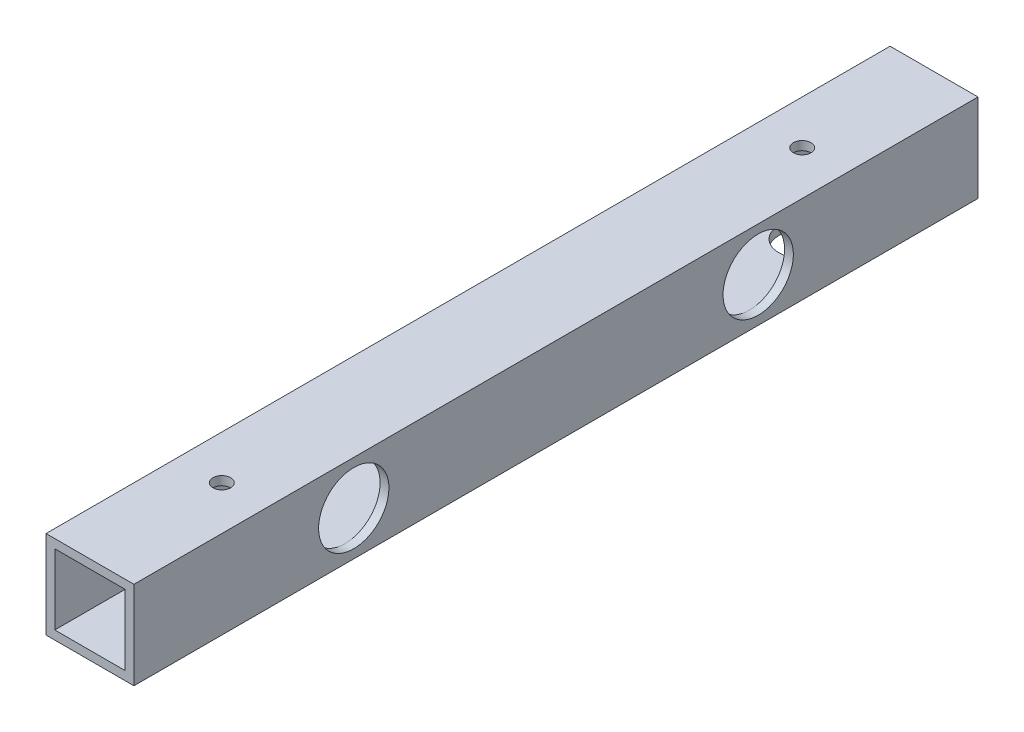
ISO-10303-21;
HEADER;
FILE_DESCRIPTION(('STEP AP214'),'2;1');
FILE_NAME('part.step','',(''),(''),'','','');
FILE_SCHEMA(('AUTOMOTIVE_DESIGN { 1 0 10303 214 1 1 1 1 }'));
ENDSEC;
DATA;
#1=APPLICATION_CONTEXT('core data for automotive mechanical design processes');
#2=APPLICATION_PROTOCOL_DEFINITION('international standard','automotive_design',2000,#1);
#3=PRODUCT_CONTEXT('',#1,'mechanical');
#4=PRODUCT('Part','Part','',(#3));
#5=PRODUCT_RELATED_PRODUCT_CATEGORY('part','',(#4));
#6=PRODUCT_DEFINITION_FORMATION('','',#4);
#7=PRODUCT_DEFINITION_CONTEXT('part definition',#1,'design');
#8=PRODUCT_DEFINITION('design','',#6,#7);
#9=PRODUCT_DEFINITION_SHAPE('','',#8);
#10=(LENGTH_UNIT() NAMED_UNIT(*) SI_UNIT(.MILLI.,.METRE.));
#11=(NAMED_UNIT(*) PLANE_ANGLE_UNIT() SI_UNIT($,.RADIAN.));
#12=(NAMED_UNIT(*) SI_UNIT($,.STERADIAN.) SOLID_ANGLE_UNIT());
#13=UNCERTAINTY_MEASURE_WITH_UNIT(LENGTH_MEASURE(1.E-05),#10,'distance_accuracy_value','');
#14=(GEOMETRIC_REPRESENTATION_CONTEXT(3) GLOBAL_UNCERTAINTY_ASSIGNED_CONTEXT((#13)) GLOBAL_UNIT_ASSIGNED_CONTEXT((#10,
#11,#12)) REPRESENTATION_CONTEXT('',''));
#15=CARTESIAN_POINT('',(0.,0.,0.));
#16=DIRECTION('',(0.,0.,1.));
#17=DIRECTION('',(1.,0.,0.));
#18=AXIS2_PLACEMENT_3D('',#15,#16,#17);
#19=CARTESIAN_POINT('',(6.48991585925549,6.23262608579252,144.));
#20=DIRECTION('',(-1.,0.,0.));
#21=DIRECTION('',(0.,-1.,0.));
#22=AXIS2_PLACEMENT_3D('',#19,#20,#21);
#23=PLANE('',#22);
#24=CARTESIAN_POINT('',(6.48991585925549,0.232626085792519,106.5));
#25=DIRECTION('',(-1.,0.,0.));
#26=DIRECTION('',(0.,-1.,0.));
#27=AXIS2_PLACEMENT_3D('',#24,#25,#26);
#28=CIRCLE('',#27,6.);
#29=CARTESIAN_POINT('',(6.48991585925549,-5.76737391420748,106.5));
#30=VERTEX_POINT('',#29);
#31=CARTESIAN_POINT('',(6.48991585925549,6.23262608579252,106.5));
#32=VERTEX_POINT('',#31);
#33=EDGE_CURVE('E49',#30,#32,#28,.T.);
#34=ORIENTED_EDGE('',*,*,#33,.F.);
#35=DIRECTION('',(0.,0.,-1.));
#36=VECTOR('',#35,1.);
#37=CARTESIAN_POINT('',(6.48991585925549,-5.76737391420748,144.));
#38=LINE('',#37,#36);
#39=CARTESIAN_POINT('',(6.48991585925549,-5.76737391420748,144.));
#40=VERTEX_POINT('',#39);
#41=EDGE_CURVE('E121',#40,#30,#38,.T.);
#42=ORIENTED_EDGE('',*,*,#41,.F.);
#43=DIRECTION('',(0.,1.,0.));
#44=VECTOR('',#43,1.);
#45=CARTESIAN_POINT('',(6.48991585925549,6.23262608579252,144.));
#46=LINE('',#45,#44);
#47=CARTESIAN_POINT('',(6.48991585925549,6.23262608579252,144.));
#48=VERTEX_POINT('',#47);
#49=EDGE_CURVE('E156',#40,#48,#46,.T.);
#50=ORIENTED_EDGE('',*,*,#49,.T.);
#51=DIRECTION('',(0.,0.,-1.));
#52=VECTOR('',#51,1.);
#53=CARTESIAN_POINT('',(6.48991585925549,6.23262608579252,144.));
#54=LINE('',#53,#52);
#55=EDGE_CURVE('E123',#48,#32,#54,.T.);
#56=ORIENTED_EDGE('',*,*,#55,.T.);
#57=EDGE_LOOP('',(#34,#42,#50,#56));
#58=FACE_BOUND('',#57,.T.);
#59=ADVANCED_FACE('F33',(#58),#23,.T.);
#60=EDGE_CURVE('E110',#32,#30,#28,.T.);
#61=ORIENTED_EDGE('',*,*,#60,.F.);
#62=CARTESIAN_POINT('',(6.48991585925549,6.23262608579252,37.5));
#63=VERTEX_POINT('',#62);
#64=EDGE_CURVE('E56',#32,#63,#54,.T.);
#65=ORIENTED_EDGE('',*,*,#64,.T.);
#66=CARTESIAN_POINT('',(6.48991585925549,0.232626085792519,37.5));
#67=DIRECTION('',(-1.,0.,0.));
#68=DIRECTION('',(0.,-1.,0.));
#69=AXIS2_PLACEMENT_3D('',#66,#67,#68);
#70=CIRCLE('',#69,5.99999999999999);
#71=CARTESIAN_POINT('',(6.48991585925549,-5.76737391420748,37.5));
#72=VERTEX_POINT('',#71);
#73=EDGE_CURVE('E127',#72,#63,#70,.T.);
#74=ORIENTED_EDGE('',*,*,#73,.F.);
#75=EDGE_CURVE('E125',#30,#72,#38,.T.);
#76=ORIENTED_EDGE('',*,*,#75,.F.);
#77=EDGE_LOOP('',(#61,#65,#74,#76));
#78=FACE_BOUND('',#77,.T.);
#79=ADVANCED_FACE('F126',(#78),#23,.T.);
#80=CARTESIAN_POINT('',(0.,0.,144.));
#81=DIRECTION('',(0.,0.,1.));
#82=DIRECTION('',(1.,0.,0.));
#83=AXIS2_PLACEMENT_3D('',#80,#81,#82);
#84=PLANE('',#83);
#85=DIRECTION('',(0.,-1.,0.));
#86=VECTOR('',#85,1.);
#87=CARTESIAN_POINT('',(-7.01008414074451,7.73262608579252,144.));
#88=LINE('',#87,#86);
#89=CARTESIAN_POINT('',(-7.01008414074451,7.73262608579252,144.));
#90=VERTEX_POINT('',#89);
#91=CARTESIAN_POINT('',(-7.01008414074451,-7.26737391420748,144.));
#92=VERTEX_POINT('',#91);
#93=EDGE_CURVE('E248',#90,#92,#88,.T.);
#94=ORIENTED_EDGE('',*,*,#93,.T.);
#95=DIRECTION('',(1.,0.,0.));
#96=VECTOR('',#95,1.);
#97=CARTESIAN_POINT('',(-7.01008414074451,-7.26737391420748,144.));
#98=LINE('',#97,#96);
#99=CARTESIAN_POINT('',(7.98991585925548,-7.26737391420748,144.));
#100=VERTEX_POINT('',#99);
#101=EDGE_CURVE('E251',#92,#100,#98,.T.);
#102=ORIENTED_EDGE('',*,*,#101,.T.);
#103=DIRECTION('',(0.,1.,0.));
#104=VECTOR('',#103,1.);
#105=CARTESIAN_POINT('',(7.98991585925549,7.73262608579252,144.));
#106=LINE('',#105,#104);
#107=CARTESIAN_POINT('',(7.98991585925549,7.73262608579252,144.));
#108=VERTEX_POINT('',#107);
#109=EDGE_CURVE('E299',#100,#108,#106,.T.);
#110=ORIENTED_EDGE('',*,*,#109,.T.);
#111=DIRECTION('',(-1.,0.,0.));
#112=VECTOR('',#111,1.);
#113=CARTESIAN_POINT('',(-7.01008414074451,7.73262608579252,144.));
#114=LINE('',#113,#112);
#115=EDGE_CURVE('E241',#108,#90,#114,.T.);
#116=ORIENTED_EDGE('',*,*,#115,.T.);
#117=EDGE_LOOP('',(#94,#102,#110,#116));
#118=FACE_BOUND('',#117,.T.);
#119=DIRECTION('',(1.,0.,0.));
#120=VECTOR('',#119,1.);
#121=CARTESIAN_POINT('',(-5.51008414074451,-5.76737391420748,144.));
#122=LINE('',#121,#120);
#123=CARTESIAN_POINT('',(-5.51008414074451,-5.76737391420748,144.));
#124=VERTEX_POINT('',#123);
#125=EDGE_CURVE('E137',#124,#40,#122,.T.);
#126=ORIENTED_EDGE('',*,*,#125,.F.);
#127=DIRECTION('',(0.,-1.,0.));
#128=VECTOR('',#127,1.);
#129=CARTESIAN_POINT('',(-5.51008414074451,6.23262608579252,144.));
#130=LINE('',#129,#128);
#131=CARTESIAN_POINT('',(-5.51008414074451,6.23262608579252,144.));
#132=VERTEX_POINT('',#131);
#133=EDGE_CURVE('E161',#132,#124,#130,.T.);
#134=ORIENTED_EDGE('',*,*,#133,.F.);
#135=DIRECTION('',(-1.,0.,0.));
#136=VECTOR('',#135,1.);
#137=CARTESIAN_POINT('',(-5.51008414074451,6.23262608579252,144.));
#138=LINE('',#137,#136);
#139=EDGE_CURVE('E152',#48,#132,#138,.T.);
#140=ORIENTED_EDGE('',*,*,#139,.F.);
#141=ORIENTED_EDGE('',*,*,#49,.F.);
#142=EDGE_LOOP('',(#126,#134,#140,#141));
#143=FACE_BOUND('',#142,.T.);
#144=ADVANCED_FACE('F302',(#118,#143),#84,.T.);
#145=CARTESIAN_POINT('',(0.,0.,0.));
#146=DIRECTION('',(0.,0.,1.));
#147=DIRECTION('',(1.,0.,0.));
#148=AXIS2_PLACEMENT_3D('',#145,#146,#147);
#149=PLANE('',#148);
#150=DIRECTION('',(0.,-1.,0.));
#151=VECTOR('',#150,1.);
#152=CARTESIAN_POINT('',(-7.01008414074451,7.73262608579252,0.));
#153=LINE('',#152,#151);
#154=CARTESIAN_POINT('',(-7.01008414074451,7.73262608579252,0.));
#155=VERTEX_POINT('',#154);
#156=CARTESIAN_POINT('',(-7.01008414074451,-7.26737391420748,0.));
#157=VERTEX_POINT('',#156);
#158=EDGE_CURVE('E140',#155,#157,#153,.T.);
#159=ORIENTED_EDGE('',*,*,#158,.F.);
#160=DIRECTION('',(-1.,0.,0.));
#161=VECTOR('',#160,1.);
#162=CARTESIAN_POINT('',(-7.01008414074451,7.73262608579252,0.));
#163=LINE('',#162,#161);
#164=CARTESIAN_POINT('',(7.98991585925549,7.73262608579252,0.));
#165=VERTEX_POINT('',#164);
#166=EDGE_CURVE('E235',#165,#155,#163,.T.);
#167=ORIENTED_EDGE('',*,*,#166,.F.);
#168=DIRECTION('',(0.,1.,0.));
#169=VECTOR('',#168,1.);
#170=CARTESIAN_POINT('',(7.98991585925549,7.73262608579252,0.));
#171=LINE('',#170,#169);
#172=CARTESIAN_POINT('',(7.98991585925548,-7.26737391420748,0.));
#173=VERTEX_POINT('',#172);
#174=EDGE_CURVE('E227',#173,#165,#171,.T.);
#175=ORIENTED_EDGE('',*,*,#174,.F.);
#176=DIRECTION('',(1.,0.,0.));
#177=VECTOR('',#176,1.);
#178=CARTESIAN_POINT('',(-7.01008414074451,-7.26737391420748,0.));
#179=LINE('',#178,#177);
#180=EDGE_CURVE('E236',#157,#173,#179,.T.);
#181=ORIENTED_EDGE('',*,*,#180,.F.);
#182=EDGE_LOOP('',(#159,#167,#175,#181));
#183=FACE_BOUND('',#182,.T.);
#184=DIRECTION('',(0.,-1.,0.));
#185=VECTOR('',#184,1.);
#186=CARTESIAN_POINT('',(-5.51008414074451,6.23262608579252,0.));
#187=LINE('',#186,#185);
#188=CARTESIAN_POINT('',(-5.51008414074451,6.23262608579252,0.));
#189=VERTEX_POINT('',#188);
#190=CARTESIAN_POINT('',(-5.51008414074451,-5.76737391420748,0.));
#191=VERTEX_POINT('',#190);
#192=EDGE_CURVE('E168',#189,#191,#187,.T.);
#193=ORIENTED_EDGE('',*,*,#192,.T.);
#194=DIRECTION('',(1.,0.,0.));
#195=VECTOR('',#194,1.);
#196=CARTESIAN_POINT('',(-5.51008414074451,-5.76737391420748,0.));
#197=LINE('',#196,#195);
#198=CARTESIAN_POINT('',(6.48991585925549,-5.76737391420748,0.));
#199=VERTEX_POINT('',#198);
#200=EDGE_CURVE('E165',#191,#199,#197,.T.);
#201=ORIENTED_EDGE('',*,*,#200,.T.);
#202=DIRECTION('',(0.,1.,0.));
#203=VECTOR('',#202,1.);
#204=CARTESIAN_POINT('',(6.48991585925549,6.23262608579252,0.));
#205=LINE('',#204,#203);
#206=CARTESIAN_POINT('',(6.48991585925549,6.23262608579252,0.));
#207=VERTEX_POINT('',#206);
#208=EDGE_CURVE('E162',#199,#207,#205,.T.);
#209=ORIENTED_EDGE('',*,*,#208,.T.);
#210=DIRECTION('',(-1.,0.,0.));
#211=VECTOR('',#210,1.);
#212=CARTESIAN_POINT('',(-5.51008414074451,6.23262608579252,0.));
#213=LINE('',#212,#211);
#214=EDGE_CURVE('E159',#207,#189,#213,.T.);
#215=ORIENTED_EDGE('',*,*,#214,.T.);
#216=EDGE_LOOP('',(#193,#201,#209,#215));
#217=FACE_BOUND('',#216,.T.);
#218=ADVANCED_FACE('F245',(#183,#217),#149,.F.);
#219=CARTESIAN_POINT('',(-7.01008414074451,7.73262608579252,144.));
#220=DIRECTION('',(1.,0.,0.));
#221=DIRECTION('',(0.,1.,0.));
#222=AXIS2_PLACEMENT_3D('',#219,#220,#221);
#223=PLANE('',#222);
#224=CARTESIAN_POINT('',(-7.01008414074451,0.232626085792519,106.5));
#225=DIRECTION('',(-1.,0.,0.));
#226=DIRECTION('',(0.,-1.,0.));
#227=AXIS2_PLACEMENT_3D('',#224,#225,#226);
#228=CIRCLE('',#227,1.5);
#229=CARTESIAN_POINT('',(-7.01008414074451,-1.26737391420748,106.5));
#230=VERTEX_POINT('',#229);
#231=EDGE_CURVE('E124',#230,#230,#228,.T.);
#232=ORIENTED_EDGE('',*,*,#231,.F.);
#233=EDGE_LOOP('',(#232));
#234=FACE_BOUND('',#233,.T.);
#235=CARTESIAN_POINT('',(-7.01008414074451,0.232626085792518,37.5));
#236=DIRECTION('',(-1.,0.,0.));
#237=DIRECTION('',(0.,-1.,0.));
#238=AXIS2_PLACEMENT_3D('',#235,#236,#237);
#239=CIRCLE('',#238,1.5);
#240=CARTESIAN_POINT('',(-7.01008414074451,-1.26737391420749,37.5));
#241=VERTEX_POINT('',#240);
#242=EDGE_CURVE('E199',#241,#241,#239,.T.);
#243=ORIENTED_EDGE('',*,*,#242,.F.);
#244=EDGE_LOOP('',(#243));
#245=FACE_BOUND('',#244,.T.);
#246=CARTESIAN_POINT('',(-7.01008414074451,0.232626085792518,7.5));
#247=DIRECTION('',(-1.,0.,0.));
#248=DIRECTION('',(0.,-1.,0.));
#249=AXIS2_PLACEMENT_3D('',#246,#247,#248);
#250=CIRCLE('',#249,1.5);
#251=CARTESIAN_POINT('',(-7.01008414074451,-1.26737391420748,7.5));
#252=VERTEX_POINT('',#251);
#253=EDGE_CURVE('E187',#252,#252,#250,.T.);
#254=ORIENTED_EDGE('',*,*,#253,.F.);
#255=EDGE_LOOP('',(#254));
#256=FACE_BOUND('',#255,.T.);
#257=CARTESIAN_POINT('',(-7.01008414074451,0.232626085792518,72.5));
#258=DIRECTION('',(-1.,0.,0.));
#259=DIRECTION('',(0.,-1.,0.));
#260=AXIS2_PLACEMENT_3D('',#257,#258,#259);
#261=CIRCLE('',#260,1.5);
#262=CARTESIAN_POINT('',(-7.01008414074451,-1.26737391420748,72.5));
#263=VERTEX_POINT('',#262);
#264=EDGE_CURVE('E175',#263,#263,#261,.T.);
#265=ORIENTED_EDGE('',*,*,#264,.F.);
#266=EDGE_LOOP('',(#265));
#267=FACE_BOUND('',#266,.T.);
#268=ORIENTED_EDGE('',*,*,#158,.T.);
#269=DIRECTION('',(0.,0.,-1.));
#270=VECTOR('',#269,1.);
#271=CARTESIAN_POINT('',(-7.01008414074451,-7.26737391420748,144.));
#272=LINE('',#271,#270);
#273=EDGE_CURVE('E11',#92,#157,#272,.T.);
#274=ORIENTED_EDGE('',*,*,#273,.F.);
#275=ORIENTED_EDGE('',*,*,#93,.F.);
#276=DIRECTION('',(0.,0.,-1.));
#277=VECTOR('',#276,1.);
#278=CARTESIAN_POINT('',(-7.01008414074451,7.73262608579252,144.));
#279=LINE('',#278,#277);
#280=EDGE_CURVE('E242',#90,#155,#279,.T.);
#281=ORIENTED_EDGE('',*,*,#280,.T.);
#282=EDGE_LOOP('',(#268,#274,#275,#281));
#283=FACE_BOUND('',#282,.T.);
#284=ADVANCED_FACE('F35',(#234,#245,#256,#267,#283),#223,.F.);
#285=CARTESIAN_POINT('',(-7.01008414074451,-7.26737391420748,144.));
#286=DIRECTION('',(0.,1.,0.));
#287=DIRECTION('',(0.,0.,1.));
#288=AXIS2_PLACEMENT_3D('',#285,#286,#287);
#289=PLANE('',#288);
#290=CARTESIAN_POINT('',(0.489915859255483,-7.26737391420748,72.5));
#291=DIRECTION('',(0.,-1.,0.));
#292=DIRECTION('',(0.,0.,-1.));
#293=AXIS2_PLACEMENT_3D('',#290,#291,#292);
#294=CIRCLE('',#293,4.);
#295=CARTESIAN_POINT('',(0.489915859255483,-7.26737391420748,68.5));
#296=VERTEX_POINT('',#295);
#297=EDGE_CURVE('E208',#296,#296,#294,.T.);
#298=ORIENTED_EDGE('',*,*,#297,.F.);
#299=EDGE_LOOP('',(#298));
#300=FACE_BOUND('',#299,.T.);
#301=CARTESIAN_POINT('',(0.489915859255488,-7.26737391420748,121.5));
#302=DIRECTION('',(0.,-1.,0.));
#303=DIRECTION('',(0.,0.,-1.));
#304=AXIS2_PLACEMENT_3D('',#301,#302,#303);
#305=CIRCLE('',#304,4.);
#306=CARTESIAN_POINT('',(0.489915859255488,-7.26737391420748,117.5));
#307=VERTEX_POINT('',#306);
#308=EDGE_CURVE('E195',#307,#307,#305,.T.);
#309=ORIENTED_EDGE('',*,*,#308,.F.);
#310=EDGE_LOOP('',(#309));
#311=FACE_BOUND('',#310,.T.);
#312=CARTESIAN_POINT('',(0.489915859255486,-7.26737391420748,22.5));
#313=DIRECTION('',(0.,-1.,0.));
#314=DIRECTION('',(0.,0.,-1.));
#315=AXIS2_PLACEMENT_3D('',#312,#313,#314);
#316=CIRCLE('',#315,4.);
#317=CARTESIAN_POINT('',(0.489915859255486,-7.26737391420748,18.5));
#318=VERTEX_POINT('',#317);
#319=EDGE_CURVE('E191',#318,#318,#316,.T.);
#320=ORIENTED_EDGE('',*,*,#319,.F.);
#321=EDGE_LOOP('',(#320));
#322=FACE_BOUND('',#321,.T.);
#323=ORIENTED_EDGE('',*,*,#180,.T.);
#324=DIRECTION('',(0.,0.,-1.));
#325=VECTOR('',#324,1.);
#326=CARTESIAN_POINT('',(7.98991585925548,-7.26737391420748,144.));
#327=LINE('',#326,#325);
#328=EDGE_CURVE('E42',#100,#173,#327,.T.);
#329=ORIENTED_EDGE('',*,*,#328,.F.);
#330=ORIENTED_EDGE('',*,*,#101,.F.);
#331=ORIENTED_EDGE('',*,*,#273,.T.);
#332=EDGE_LOOP('',(#323,#329,#330,#331));
#333=FACE_BOUND('',#332,.T.);
#334=ADVANCED_FACE('F220',(#300,#311,#322,#333),#289,.F.);
#335=CARTESIAN_POINT('',(7.98991585925549,7.73262608579252,144.));
#336=DIRECTION('',(-1.,0.,0.));
#337=DIRECTION('',(0.,-1.,0.));
#338=AXIS2_PLACEMENT_3D('',#335,#336,#337);
#339=PLANE('',#338);
#340=CARTESIAN_POINT('',(7.98991585925548,0.232626085792518,106.5));
#341=DIRECTION('',(1.,0.,0.));
#342=DIRECTION('',(0.,1.,0.));
#343=AXIS2_PLACEMENT_3D('',#340,#341,#342);
#344=CIRCLE('',#343,6.);
#345=CARTESIAN_POINT('',(7.98991585925549,6.23262608579252,106.5));
#346=VERTEX_POINT('',#345);
#347=EDGE_CURVE('E114',#346,#346,#344,.T.);
#348=ORIENTED_EDGE('',*,*,#347,.F.);
#349=EDGE_LOOP('',(#348));
#350=FACE_BOUND('',#349,.T.);
#351=CARTESIAN_POINT('',(7.98991585925548,0.232626085792518,37.5));
#352=DIRECTION('',(1.,0.,0.));
#353=DIRECTION('',(0.,1.,0.));
#354=AXIS2_PLACEMENT_3D('',#351,#352,#353);
#355=CIRCLE('',#354,5.99999999999999);
#356=CARTESIAN_POINT('',(7.98991585925549,6.23262608579251,37.5));
#357=VERTEX_POINT('',#356);
#358=EDGE_CURVE('E204',#357,#357,#355,.T.);
#359=ORIENTED_EDGE('',*,*,#358,.F.);
#360=EDGE_LOOP('',(#359));
#361=FACE_BOUND('',#360,.T.);
#362=ORIENTED_EDGE('',*,*,#174,.T.);
#363=DIRECTION('',(0.,0.,-1.));
#364=VECTOR('',#363,1.);
#365=CARTESIAN_POINT('',(7.98991585925549,7.73262608579252,144.));
#366=LINE('',#365,#364);
#367=EDGE_CURVE('E230',#108,#165,#366,.T.);
#368=ORIENTED_EDGE('',*,*,#367,.F.);
#369=ORIENTED_EDGE('',*,*,#109,.F.);
#370=ORIENTED_EDGE('',*,*,#328,.T.);
#371=EDGE_LOOP('',(#362,#368,#369,#370));
#372=FACE_BOUND('',#371,.T.);
#373=ADVANCED_FACE('F216',(#350,#361,#372),#339,.F.);
#374=CARTESIAN_POINT('',(-7.01008414074451,7.73262608579252,144.));
#375=DIRECTION('',(0.,-1.,0.));
#376=DIRECTION('',(0.,0.,-1.));
#377=AXIS2_PLACEMENT_3D('',#374,#375,#376);
#378=PLANE('',#377);
#379=CARTESIAN_POINT('',(0.489915859255486,7.73262608579252,121.5));
#380=DIRECTION('',(0.,1.,0.));
#381=DIRECTION('',(0.,0.,1.));
#382=AXIS2_PLACEMENT_3D('',#379,#380,#381);
#383=CIRCLE('',#382,1.5);
#384=CARTESIAN_POINT('',(0.489915859255486,7.73262608579252,123.));
#385=VERTEX_POINT('',#384);
#386=EDGE_CURVE('E183',#385,#385,#383,.T.);
#387=ORIENTED_EDGE('',*,*,#386,.F.);
#388=EDGE_LOOP('',(#387));
#389=FACE_BOUND('',#388,.T.);
#390=CARTESIAN_POINT('',(0.489915859255486,7.73262608579252,22.5));
#391=DIRECTION('',(0.,1.,0.));
#392=DIRECTION('',(0.,0.,1.));
#393=AXIS2_PLACEMENT_3D('',#390,#391,#392);
#394=CIRCLE('',#393,1.5);
#395=CARTESIAN_POINT('',(0.489915859255486,7.73262608579252,24.));
#396=VERTEX_POINT('',#395);
#397=EDGE_CURVE('E179',#396,#396,#394,.T.);
#398=ORIENTED_EDGE('',*,*,#397,.F.);
#399=EDGE_LOOP('',(#398));
#400=FACE_BOUND('',#399,.T.);
#401=ORIENTED_EDGE('',*,*,#166,.T.);
#402=ORIENTED_EDGE('',*,*,#280,.F.);
#403=ORIENTED_EDGE('',*,*,#115,.F.);
#404=ORIENTED_EDGE('',*,*,#367,.T.);
#405=EDGE_LOOP('',(#401,#402,#403,#404));
#406=FACE_BOUND('',#405,.T.);
#407=ADVANCED_FACE('F219',(#389,#400,#406),#378,.F.);
#408=CARTESIAN_POINT('',(-5.51008414074451,6.23262608579252,144.));
#409=DIRECTION('',(1.,0.,0.));
#410=DIRECTION('',(0.,1.,0.));
#411=AXIS2_PLACEMENT_3D('',#408,#409,#410);
#412=PLANE('',#411);
#413=CARTESIAN_POINT('',(-5.51008414074451,0.232626085792519,106.5));
#414=DIRECTION('',(1.,0.,0.));
#415=DIRECTION('',(0.,1.,0.));
#416=AXIS2_PLACEMENT_3D('',#413,#414,#415);
#417=CIRCLE('',#416,1.5);
#418=CARTESIAN_POINT('',(-5.51008414074451,1.73262608579252,106.5));
#419=VERTEX_POINT('',#418);
#420=EDGE_CURVE('E37',#419,#419,#417,.T.);
#421=ORIENTED_EDGE('',*,*,#420,.F.);
#422=EDGE_LOOP('',(#421));
#423=FACE_BOUND('',#422,.T.);
#424=CARTESIAN_POINT('',(-5.51008414074451,0.232626085792519,37.5));
#425=DIRECTION('',(1.,0.,0.));
#426=DIRECTION('',(0.,1.,0.));
#427=AXIS2_PLACEMENT_3D('',#424,#425,#426);
#428=CIRCLE('',#427,1.5);
#429=CARTESIAN_POINT('',(-5.51008414074451,1.73262608579252,37.5));
#430=VERTEX_POINT('',#429);
#431=EDGE_CURVE('E198',#430,#430,#428,.T.);
#432=ORIENTED_EDGE('',*,*,#431,.F.);
#433=EDGE_LOOP('',(#432));
#434=FACE_BOUND('',#433,.T.);
#435=CARTESIAN_POINT('',(-5.51008414074451,0.232626085792519,7.5));
#436=DIRECTION('',(1.,0.,0.));
#437=DIRECTION('',(0.,1.,0.));
#438=AXIS2_PLACEMENT_3D('',#435,#436,#437);
#439=CIRCLE('',#438,1.5);
#440=CARTESIAN_POINT('',(-5.51008414074451,1.73262608579252,7.5));
#441=VERTEX_POINT('',#440);
#442=EDGE_CURVE('E186',#441,#441,#439,.T.);
#443=ORIENTED_EDGE('',*,*,#442,.F.);
#444=EDGE_LOOP('',(#443));
#445=FACE_BOUND('',#444,.T.);
#446=CARTESIAN_POINT('',(-5.51008414074451,0.232626085792519,72.5));
#447=DIRECTION('',(1.,0.,0.));
#448=DIRECTION('',(0.,1.,0.));
#449=AXIS2_PLACEMENT_3D('',#446,#447,#448);
#450=CIRCLE('',#449,1.5);
#451=CARTESIAN_POINT('',(-5.51008414074451,1.73262608579252,72.5));
#452=VERTEX_POINT('',#451);
#453=EDGE_CURVE('E170',#452,#452,#450,.T.);
#454=ORIENTED_EDGE('',*,*,#453,.F.);
#455=EDGE_LOOP('',(#454));
#456=FACE_BOUND('',#455,.T.);
#457=ORIENTED_EDGE('',*,*,#192,.F.);
#458=DIRECTION('',(0.,0.,-1.));
#459=VECTOR('',#458,1.);
#460=CARTESIAN_POINT('',(-5.51008414074451,6.23262608579252,144.));
#461=LINE('',#460,#459);
#462=EDGE_CURVE('E146',#132,#189,#461,.T.);
#463=ORIENTED_EDGE('',*,*,#462,.F.);
#464=ORIENTED_EDGE('',*,*,#133,.T.);
#465=DIRECTION('',(0.,0.,-1.));
#466=VECTOR('',#465,1.);
#467=CARTESIAN_POINT('',(-5.51008414074451,-5.76737391420748,144.));
#468=LINE('',#467,#466);
#469=EDGE_CURVE('E138',#124,#191,#468,.T.);
#470=ORIENTED_EDGE('',*,*,#469,.T.);
#471=EDGE_LOOP('',(#457,#463,#464,#470));
#472=FACE_BOUND('',#471,.T.);
#473=ADVANCED_FACE('F278',(#423,#434,#445,#456,#472),#412,.T.);
#474=CARTESIAN_POINT('',(-5.51008414074451,-5.76737391420748,144.));
#475=DIRECTION('',(0.,1.,0.));
#476=DIRECTION('',(0.,0.,1.));
#477=AXIS2_PLACEMENT_3D('',#474,#475,#476);
#478=PLANE('',#477);
#479=ORIENTED_EDGE('',*,*,#41,.T.);
#480=ORIENTED_EDGE('',*,*,#75,.T.);
#481=EDGE_CURVE('E131',#72,#199,#38,.T.);
#482=ORIENTED_EDGE('',*,*,#481,.T.);
#483=ORIENTED_EDGE('',*,*,#200,.F.);
#484=ORIENTED_EDGE('',*,*,#469,.F.);
#485=ORIENTED_EDGE('',*,*,#125,.T.);
#486=EDGE_LOOP('',(#479,#480,#482,#483,#484,#485));
#487=FACE_BOUND('',#486,.T.);
#488=CARTESIAN_POINT('',(0.489915859255483,-5.76737391420748,72.5));
#489=DIRECTION('',(0.,1.,0.));
#490=DIRECTION('',(0.,0.,1.));
#491=AXIS2_PLACEMENT_3D('',#488,#489,#490);
#492=CIRCLE('',#491,4.);
#493=CARTESIAN_POINT('',(0.489915859255483,-5.76737391420748,76.5));
#494=VERTEX_POINT('',#493);
#495=EDGE_CURVE('E207',#494,#494,#492,.T.);
#496=ORIENTED_EDGE('',*,*,#495,.F.);
#497=EDGE_LOOP('',(#496));
#498=FACE_BOUND('',#497,.T.);
#499=CARTESIAN_POINT('',(0.489915859255488,-5.76737391420748,121.5));
#500=DIRECTION('',(0.,1.,0.));
#501=DIRECTION('',(0.,0.,1.));
#502=AXIS2_PLACEMENT_3D('',#499,#500,#501);
#503=CIRCLE('',#502,4.);
#504=CARTESIAN_POINT('',(0.489915859255488,-5.76737391420748,125.5));
#505=VERTEX_POINT('',#504);
#506=EDGE_CURVE('E194',#505,#505,#503,.T.);
#507=ORIENTED_EDGE('',*,*,#506,.F.);
#508=EDGE_LOOP('',(#507));
#509=FACE_BOUND('',#508,.T.);
#510=CARTESIAN_POINT('',(0.489915859255486,-5.76737391420748,22.5));
#511=DIRECTION('',(0.,1.,0.));
#512=DIRECTION('',(0.,0.,1.));
#513=AXIS2_PLACEMENT_3D('',#510,#511,#512);
#514=CIRCLE('',#513,4.);
#515=CARTESIAN_POINT('',(0.489915859255486,-5.76737391420748,26.5));
#516=VERTEX_POINT('',#515);
#517=EDGE_CURVE('E190',#516,#516,#514,.T.);
#518=ORIENTED_EDGE('',*,*,#517,.F.);
#519=EDGE_LOOP('',(#518));
#520=FACE_BOUND('',#519,.T.);
#521=ADVANCED_FACE('F133',(#487,#498,#509,#520),#478,.T.);
#522=EDGE_CURVE('E202',#63,#72,#70,.T.);
#523=ORIENTED_EDGE('',*,*,#522,.F.);
#524=EDGE_CURVE('E144',#63,#207,#54,.T.);
#525=ORIENTED_EDGE('',*,*,#524,.T.);
#526=ORIENTED_EDGE('',*,*,#208,.F.);
#527=ORIENTED_EDGE('',*,*,#481,.F.);
#528=EDGE_LOOP('',(#523,#525,#526,#527));
#529=FACE_BOUND('',#528,.T.);
#530=ADVANCED_FACE('F277',(#529),#23,.T.);
#531=CARTESIAN_POINT('',(-5.51008414074451,6.23262608579252,144.));
#532=DIRECTION('',(0.,-1.,0.));
#533=DIRECTION('',(0.,0.,-1.));
#534=AXIS2_PLACEMENT_3D('',#531,#532,#533);
#535=PLANE('',#534);
#536=ORIENTED_EDGE('',*,*,#64,.F.);
#537=ORIENTED_EDGE('',*,*,#55,.F.);
#538=ORIENTED_EDGE('',*,*,#139,.T.);
#539=ORIENTED_EDGE('',*,*,#462,.T.);
#540=ORIENTED_EDGE('',*,*,#214,.F.);
#541=ORIENTED_EDGE('',*,*,#524,.F.);
#542=EDGE_LOOP('',(#536,#537,#538,#539,#540,#541));
#543=FACE_BOUND('',#542,.T.);
#544=CARTESIAN_POINT('',(0.489915859255486,6.23262608579252,121.5));
#545=DIRECTION('',(0.,-1.,0.));
#546=DIRECTION('',(0.,0.,-1.));
#547=AXIS2_PLACEMENT_3D('',#544,#545,#546);
#548=CIRCLE('',#547,1.5);
#549=CARTESIAN_POINT('',(0.489915859255486,6.23262608579252,120.));
#550=VERTEX_POINT('',#549);
#551=EDGE_CURVE('E182',#550,#550,#548,.T.);
#552=ORIENTED_EDGE('',*,*,#551,.F.);
#553=EDGE_LOOP('',(#552));
#554=FACE_BOUND('',#553,.T.);
#555=CARTESIAN_POINT('',(0.489915859255486,6.23262608579252,22.5));
#556=DIRECTION('',(0.,-1.,0.));
#557=DIRECTION('',(0.,0.,-1.));
#558=AXIS2_PLACEMENT_3D('',#555,#556,#557);
#559=CIRCLE('',#558,1.5);
#560=CARTESIAN_POINT('',(0.489915859255486,6.23262608579252,21.));
#561=VERTEX_POINT('',#560);
#562=EDGE_CURVE('E178',#561,#561,#559,.T.);
#563=ORIENTED_EDGE('',*,*,#562,.F.);
#564=EDGE_LOOP('',(#563));
#565=FACE_BOUND('',#564,.T.);
#566=ADVANCED_FACE('F321',(#543,#554,#565),#535,.T.);
#567=CARTESIAN_POINT('',(2.98991585925549,0.23262608579252,72.5));
#568=DIRECTION('',(-1.,0.,0.));
#569=DIRECTION('',(0.,-1.,0.));
#570=AXIS2_PLACEMENT_3D('',#567,#568,#569);
#571=CYLINDRICAL_SURFACE('',#570,1.5);
#572=ORIENTED_EDGE('',*,*,#453,.T.);
#573=EDGE_LOOP('',(#572));
#574=FACE_BOUND('',#573,.T.);
#575=ORIENTED_EDGE('',*,*,#264,.T.);
#576=EDGE_LOOP('',(#575));
#577=FACE_BOUND('',#576,.T.);
#578=ADVANCED_FACE('F325',(#574,#577),#571,.F.);
#579=CARTESIAN_POINT('',(0.489915859255486,-2.26737391420748,22.5));
#580=DIRECTION('',(0.,1.,0.));
#581=DIRECTION('',(0.,0.,1.));
#582=AXIS2_PLACEMENT_3D('',#579,#580,#581);
#583=CYLINDRICAL_SURFACE('',#582,1.5);
#584=ORIENTED_EDGE('',*,*,#562,.T.);
#585=EDGE_LOOP('',(#584));
#586=FACE_BOUND('',#585,.T.);
#587=ORIENTED_EDGE('',*,*,#397,.T.);
#588=EDGE_LOOP('',(#587));
#589=FACE_BOUND('',#588,.T.);
#590=ADVANCED_FACE('F347',(#586,#589),#583,.F.);
#591=CARTESIAN_POINT('',(0.489915859255486,-2.26737391420748,121.5));
#592=DIRECTION('',(0.,1.,0.));
#593=DIRECTION('',(0.,0.,1.));
#594=AXIS2_PLACEMENT_3D('',#591,#592,#593);
#595=CYLINDRICAL_SURFACE('',#594,1.5);
#596=ORIENTED_EDGE('',*,*,#551,.T.);
#597=EDGE_LOOP('',(#596));
#598=FACE_BOUND('',#597,.T.);
#599=ORIENTED_EDGE('',*,*,#386,.T.);
#600=EDGE_LOOP('',(#599));
#601=FACE_BOUND('',#600,.T.);
#602=ADVANCED_FACE('F349',(#598,#601),#595,.F.);
#603=CARTESIAN_POINT('',(2.98991585925549,0.23262608579252,7.5));
#604=DIRECTION('',(-1.,0.,0.));
#605=DIRECTION('',(0.,-1.,0.));
#606=AXIS2_PLACEMENT_3D('',#603,#604,#605);
#607=CYLINDRICAL_SURFACE('',#606,1.5);
#608=ORIENTED_EDGE('',*,*,#442,.T.);
#609=EDGE_LOOP('',(#608));
#610=FACE_BOUND('',#609,.T.);
#611=ORIENTED_EDGE('',*,*,#253,.T.);
#612=EDGE_LOOP('',(#611));
#613=FACE_BOUND('',#612,.T.);
#614=ADVANCED_FACE('F288',(#610,#613),#607,.F.);
#615=CARTESIAN_POINT('',(0.489915859255486,2.73262608579252,22.5));
#616=DIRECTION('',(0.,-1.,0.));
#617=DIRECTION('',(0.,0.,-1.));
#618=AXIS2_PLACEMENT_3D('',#615,#616,#617);
#619=CYLINDRICAL_SURFACE('',#618,4.);
#620=ORIENTED_EDGE('',*,*,#517,.T.);
#621=EDGE_LOOP('',(#620));
#622=FACE_BOUND('',#621,.T.);
#623=ORIENTED_EDGE('',*,*,#319,.T.);
#624=EDGE_LOOP('',(#623));
#625=FACE_BOUND('',#624,.T.);
#626=ADVANCED_FACE('F284',(#622,#625),#619,.F.);
#627=CARTESIAN_POINT('',(0.489915859255488,2.73262608579252,121.5));
#628=DIRECTION('',(0.,-1.,0.));
#629=DIRECTION('',(0.,0.,-1.));
#630=AXIS2_PLACEMENT_3D('',#627,#628,#629);
#631=CYLINDRICAL_SURFACE('',#630,4.);
#632=ORIENTED_EDGE('',*,*,#506,.T.);
#633=EDGE_LOOP('',(#632));
#634=FACE_BOUND('',#633,.T.);
#635=ORIENTED_EDGE('',*,*,#308,.T.);
#636=EDGE_LOOP('',(#635));
#637=FACE_BOUND('',#636,.T.);
#638=ADVANCED_FACE('F287',(#634,#637),#631,.F.);
#639=CARTESIAN_POINT('',(2.98991585925549,0.23262608579252,37.5));
#640=DIRECTION('',(-1.,0.,0.));
#641=DIRECTION('',(0.,-1.,0.));
#642=AXIS2_PLACEMENT_3D('',#639,#640,#641);
#643=CYLINDRICAL_SURFACE('',#642,1.5);
#644=ORIENTED_EDGE('',*,*,#431,.T.);
#645=EDGE_LOOP('',(#644));
#646=FACE_BOUND('',#645,.T.);
#647=ORIENTED_EDGE('',*,*,#242,.T.);
#648=EDGE_LOOP('',(#647));
#649=FACE_BOUND('',#648,.T.);
#650=ADVANCED_FACE('F366',(#646,#649),#643,.F.);
#651=CARTESIAN_POINT('',(-2.01008414074452,0.232626085792521,37.5));
#652=DIRECTION('',(1.,0.,0.));
#653=DIRECTION('',(0.,1.,0.));
#654=AXIS2_PLACEMENT_3D('',#651,#652,#653);
#655=CYLINDRICAL_SURFACE('',#654,5.99999999999999);
#656=ORIENTED_EDGE('',*,*,#73,.T.);
#657=ORIENTED_EDGE('',*,*,#522,.T.);
#658=EDGE_LOOP('',(#656,#657));
#659=FACE_BOUND('',#658,.T.);
#660=ORIENTED_EDGE('',*,*,#358,.T.);
#661=EDGE_LOOP('',(#660));
#662=FACE_BOUND('',#661,.T.);
#663=ADVANCED_FACE('F370',(#659,#662),#655,.F.);
#664=CARTESIAN_POINT('',(0.489915859255483,2.73262608579252,72.5));
#665=DIRECTION('',(0.,-1.,0.));
#666=DIRECTION('',(0.,0.,-1.));
#667=AXIS2_PLACEMENT_3D('',#664,#665,#666);
#668=CYLINDRICAL_SURFACE('',#667,4.);
#669=ORIENTED_EDGE('',*,*,#495,.T.);
#670=EDGE_LOOP('',(#669));
#671=FACE_BOUND('',#670,.T.);
#672=ORIENTED_EDGE('',*,*,#297,.T.);
#673=EDGE_LOOP('',(#672));
#674=FACE_BOUND('',#673,.T.);
#675=ADVANCED_FACE('F273',(#671,#674),#668,.F.);
#676=CARTESIAN_POINT('',(2.98991585925549,0.232626085792521,106.5));
#677=DIRECTION('',(-1.,0.,0.));
#678=DIRECTION('',(0.,-1.,0.));
#679=AXIS2_PLACEMENT_3D('',#676,#677,#678);
#680=CYLINDRICAL_SURFACE('',#679,1.5);
#681=ORIENTED_EDGE('',*,*,#420,.T.);
#682=EDGE_LOOP('',(#681));
#683=FACE_BOUND('',#682,.T.);
#684=ORIENTED_EDGE('',*,*,#231,.T.);
#685=EDGE_LOOP('',(#684));
#686=FACE_BOUND('',#685,.T.);
#687=ADVANCED_FACE('F376',(#683,#686),#680,.F.);
#688=CARTESIAN_POINT('',(-2.01008414074452,0.232626085792521,106.5));
#689=DIRECTION('',(1.,0.,0.));
#690=DIRECTION('',(0.,1.,0.));
#691=AXIS2_PLACEMENT_3D('',#688,#689,#690);
#692=CYLINDRICAL_SURFACE('',#691,6.);
#693=ORIENTED_EDGE('',*,*,#33,.T.);
#694=ORIENTED_EDGE('',*,*,#60,.T.);
#695=EDGE_LOOP('',(#693,#694));
#696=FACE_BOUND('',#695,.T.);
#697=ORIENTED_EDGE('',*,*,#347,.T.);
#698=EDGE_LOOP('',(#697));
#699=FACE_BOUND('',#698,.T.);
#700=ADVANCED_FACE('F111',(#696,#699),#692,.F.);
#701=CLOSED_SHELL('',(#59,#79,#144,#218,#284,#334,#373,#407,#473,#521,#530,#566,#578,#590,#602,
#614,#626,#638,#650,#663,#675,#687,#700));
#702=MANIFOLD_SOLID_BREP('B2',#701);
#703=ADVANCED_BREP_SHAPE_REPRESENTATION('',(#18,#702),#14);
#704=SHAPE_DEFINITION_REPRESENTATION(#9,#703);
ENDSEC;
END-ISO-10303-21;
